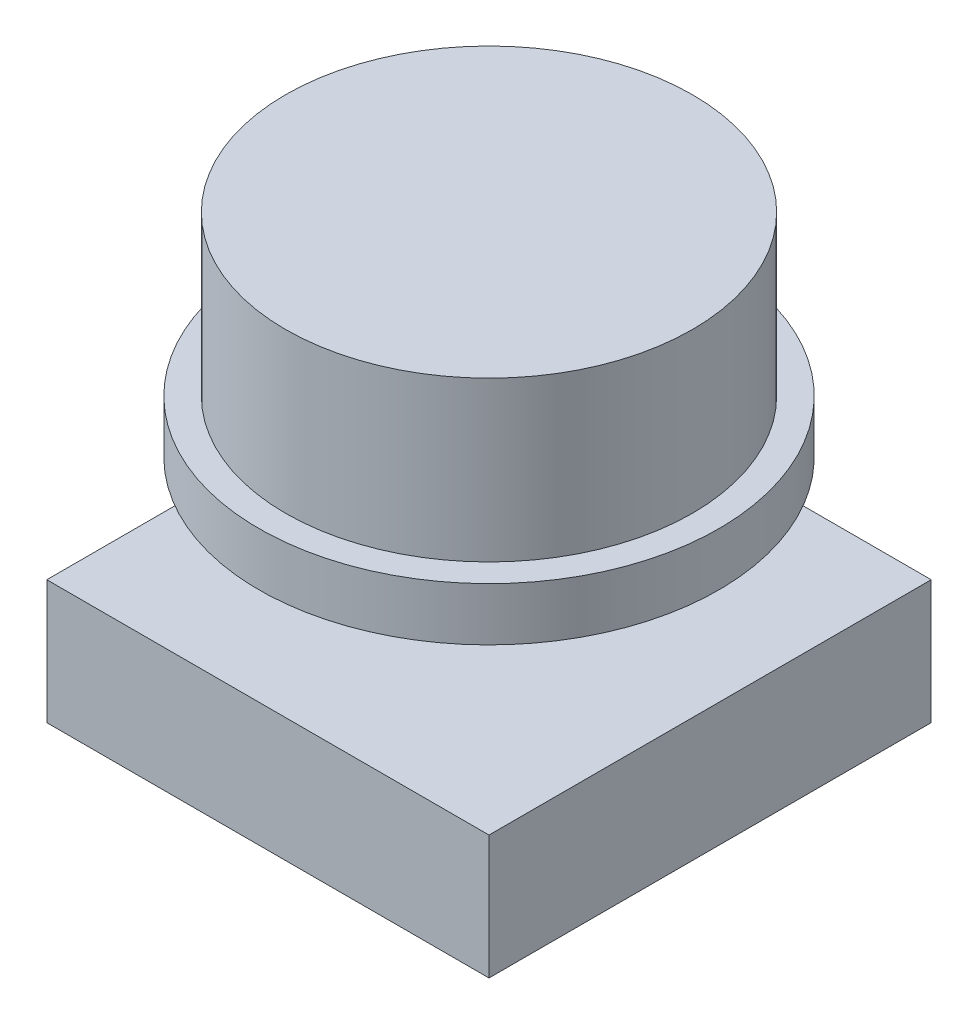
ISO-10303-21;
HEADER;
FILE_DESCRIPTION(('STEP AP214'),'2;1');
FILE_NAME('part.step','',(''),(''),'','','');
FILE_SCHEMA(('AUTOMOTIVE_DESIGN { 1 0 10303 214 1 1 1 1 }'));
ENDSEC;
DATA;
#1=APPLICATION_CONTEXT('core data for automotive mechanical design processes');
#2=APPLICATION_PROTOCOL_DEFINITION('international standard','automotive_design',2000,#1);
#3=PRODUCT_CONTEXT('',#1,'mechanical');
#4=PRODUCT('Part','Part','',(#3));
#5=PRODUCT_RELATED_PRODUCT_CATEGORY('part','',(#4));
#6=PRODUCT_DEFINITION_FORMATION('','',#4);
#7=PRODUCT_DEFINITION_CONTEXT('part definition',#1,'design');
#8=PRODUCT_DEFINITION('design','',#6,#7);
#9=PRODUCT_DEFINITION_SHAPE('','',#8);
#10=(LENGTH_UNIT() NAMED_UNIT(*) SI_UNIT(.MILLI.,.METRE.));
#11=(NAMED_UNIT(*) PLANE_ANGLE_UNIT() SI_UNIT($,.RADIAN.));
#12=(NAMED_UNIT(*) SI_UNIT($,.STERADIAN.) SOLID_ANGLE_UNIT());
#13=UNCERTAINTY_MEASURE_WITH_UNIT(LENGTH_MEASURE(1.E-05),#10,'distance_accuracy_value','');
#14=(GEOMETRIC_REPRESENTATION_CONTEXT(3) GLOBAL_UNCERTAINTY_ASSIGNED_CONTEXT((#13)) GLOBAL_UNIT_ASSIGNED_CONTEXT((#10,
#11,#12)) REPRESENTATION_CONTEXT('',''));
#15=CARTESIAN_POINT('',(0.,0.,0.));
#16=DIRECTION('',(0.,0.,1.));
#17=DIRECTION('',(1.,0.,0.));
#18=AXIS2_PLACEMENT_3D('',#15,#16,#17);
#19=CARTESIAN_POINT('',(0.,6.,0.));
#20=DIRECTION('',(0.,-1.,0.));
#21=DIRECTION('',(0.,0.,-1.));
#22=AXIS2_PLACEMENT_3D('',#19,#20,#21);
#23=CYLINDRICAL_SURFACE('',#22,5.75);
#24=CARTESIAN_POINT('',(0.,6.,0.));
#25=DIRECTION('',(0.,1.,0.));
#26=DIRECTION('',(0.,0.,1.));
#27=AXIS2_PLACEMENT_3D('',#24,#25,#26);
#28=CIRCLE('',#27,5.75);
#29=CARTESIAN_POINT('',(0.,6.,5.75));
#30=VERTEX_POINT('',#29);
#31=EDGE_CURVE('E190',#30,#30,#28,.T.);
#32=ORIENTED_EDGE('',*,*,#31,.F.);
#33=EDGE_LOOP('',(#32));
#34=FACE_BOUND('',#33,.T.);
#35=CARTESIAN_POINT('',(0.,1.5,0.));
#36=DIRECTION('',(0.,-1.,0.));
#37=DIRECTION('',(0.,0.,-1.));
#38=AXIS2_PLACEMENT_3D('',#35,#36,#37);
#39=CIRCLE('',#38,5.75);
#40=CARTESIAN_POINT('',(0.,1.5,-5.75));
#41=VERTEX_POINT('',#40);
#42=EDGE_CURVE('E197',#41,#41,#39,.T.);
#43=ORIENTED_EDGE('',*,*,#42,.F.);
#44=EDGE_LOOP('',(#43));
#45=FACE_BOUND('',#44,.T.);
#46=ADVANCED_FACE('F45',(#34,#45),#23,.T.);
#47=CARTESIAN_POINT('',(0.,6.,0.));
#48=DIRECTION('',(0.,1.,0.));
#49=DIRECTION('',(0.,0.,1.));
#50=AXIS2_PLACEMENT_3D('',#47,#48,#49);
#51=PLANE('',#50);
#52=ORIENTED_EDGE('',*,*,#31,.T.);
#53=EDGE_LOOP('',(#52));
#54=FACE_BOUND('',#53,.T.);
#55=ADVANCED_FACE('F238',(#54),#51,.T.);
#56=CARTESIAN_POINT('',(0.,1.5,0.));
#57=DIRECTION('',(0.,-1.,0.));
#58=DIRECTION('',(0.,0.,-1.));
#59=AXIS2_PLACEMENT_3D('',#56,#57,#58);
#60=CYLINDRICAL_SURFACE('',#59,6.5);
#61=CARTESIAN_POINT('',(0.,1.5,0.));
#62=DIRECTION('',(0.,-1.,0.));
#63=DIRECTION('',(0.,0.,-1.));
#64=AXIS2_PLACEMENT_3D('',#61,#62,#63);
#65=CIRCLE('',#64,6.5);
#66=CARTESIAN_POINT('',(0.,1.5,-6.5));
#67=VERTEX_POINT('',#66);
#68=EDGE_CURVE('E186',#67,#67,#65,.T.);
#69=ORIENTED_EDGE('',*,*,#68,.T.);
#70=EDGE_LOOP('',(#69));
#71=FACE_BOUND('',#70,.T.);
#72=CARTESIAN_POINT('',(0.,0.,0.));
#73=DIRECTION('',(0.,-1.,0.));
#74=DIRECTION('',(0.,0.,-1.));
#75=AXIS2_PLACEMENT_3D('',#72,#73,#74);
#76=CIRCLE('',#75,6.5);
#77=CARTESIAN_POINT('',(0.,0.,-6.5));
#78=VERTEX_POINT('',#77);
#79=EDGE_CURVE('E177',#78,#78,#76,.T.);
#80=ORIENTED_EDGE('',*,*,#79,.F.);
#81=EDGE_LOOP('',(#80));
#82=FACE_BOUND('',#81,.T.);
#83=ADVANCED_FACE('F243',(#71,#82),#60,.T.);
#84=CARTESIAN_POINT('',(0.,1.5,0.));
#85=DIRECTION('',(0.,-1.,0.));
#86=DIRECTION('',(0.,0.,-1.));
#87=AXIS2_PLACEMENT_3D('',#84,#85,#86);
#88=PLANE('',#87);
#89=ORIENTED_EDGE('',*,*,#42,.T.);
#90=EDGE_LOOP('',(#89));
#91=FACE_BOUND('',#90,.T.);
#92=ORIENTED_EDGE('',*,*,#68,.F.);
#93=EDGE_LOOP('',(#92));
#94=FACE_BOUND('',#93,.T.);
#95=ADVANCED_FACE('F250',(#91,#94),#88,.F.);
#96=CARTESIAN_POINT('',(0.,0.,0.));
#97=DIRECTION('',(0.,1.,0.));
#98=DIRECTION('',(0.,0.,1.));
#99=AXIS2_PLACEMENT_3D('',#96,#97,#98);
#100=PLANE('',#99);
#101=DIRECTION('',(-1.,0.,0.));
#102=VECTOR('',#101,1.);
#103=CARTESIAN_POINT('',(0.,0.,-1.5));
#104=LINE('',#103,#102);
#105=CARTESIAN_POINT('',(1.5,0.,-1.5));
#106=VERTEX_POINT('',#105);
#107=CARTESIAN_POINT('',(-1.5,0.,-1.5));
#108=VERTEX_POINT('',#107);
#109=EDGE_CURVE('E209',#106,#108,#104,.T.);
#110=ORIENTED_EDGE('',*,*,#109,.T.);
#111=DIRECTION('',(0.,0.,1.));
#112=VECTOR('',#111,1.);
#113=CARTESIAN_POINT('',(-1.5,0.,0.));
#114=LINE('',#113,#112);
#115=CARTESIAN_POINT('',(-1.5,0.,1.5));
#116=VERTEX_POINT('',#115);
#117=EDGE_CURVE('E53',#108,#116,#114,.T.);
#118=ORIENTED_EDGE('',*,*,#117,.T.);
#119=DIRECTION('',(1.,0.,0.));
#120=VECTOR('',#119,1.);
#121=CARTESIAN_POINT('',(0.,0.,1.5));
#122=LINE('',#121,#120);
#123=CARTESIAN_POINT('',(1.5,0.,1.5));
#124=VERTEX_POINT('',#123);
#125=EDGE_CURVE('E201',#116,#124,#122,.T.);
#126=ORIENTED_EDGE('',*,*,#125,.T.);
#127=DIRECTION('',(0.,0.,-1.));
#128=VECTOR('',#127,1.);
#129=CARTESIAN_POINT('',(1.5,0.,0.));
#130=LINE('',#129,#128);
#131=EDGE_CURVE('E205',#124,#106,#130,.T.);
#132=ORIENTED_EDGE('',*,*,#131,.T.);
#133=EDGE_LOOP('',(#110,#118,#126,#132));
#134=FACE_BOUND('',#133,.T.);
#135=ORIENTED_EDGE('',*,*,#79,.T.);
#136=EDGE_LOOP('',(#135));
#137=FACE_BOUND('',#136,.T.);
#138=ADVANCED_FACE('F216',(#134,#137),#100,.F.);
#139=CARTESIAN_POINT('',(-1.5,-6.5,0.));
#140=DIRECTION('',(-1.,0.,0.));
#141=DIRECTION('',(0.,0.,1.));
#142=AXIS2_PLACEMENT_3D('',#139,#140,#141);
#143=PLANE('',#142);
#144=DIRECTION('',(0.,0.,-1.));
#145=VECTOR('',#144,1.);
#146=CARTESIAN_POINT('',(-1.5,-3.,0.));
#147=LINE('',#146,#145);
#148=CARTESIAN_POINT('',(-1.5,-3.,1.5));
#149=VERTEX_POINT('',#148);
#150=CARTESIAN_POINT('',(-1.5,-3.,-1.5));
#151=VERTEX_POINT('',#150);
#152=EDGE_CURVE('E169',#149,#151,#147,.T.);
#153=ORIENTED_EDGE('',*,*,#152,.F.);
#154=DIRECTION('',(0.,1.,0.));
#155=VECTOR('',#154,1.);
#156=CARTESIAN_POINT('',(-1.5,-6.5,1.5));
#157=LINE('',#156,#155);
#158=EDGE_CURVE('E173',#149,#116,#157,.T.);
#159=ORIENTED_EDGE('',*,*,#158,.T.);
#160=ORIENTED_EDGE('',*,*,#117,.F.);
#161=DIRECTION('',(0.,1.,0.));
#162=VECTOR('',#161,1.);
#163=CARTESIAN_POINT('',(-1.5,-6.5,-1.5));
#164=LINE('',#163,#162);
#165=EDGE_CURVE('E174',#151,#108,#164,.T.);
#166=ORIENTED_EDGE('',*,*,#165,.F.);
#167=EDGE_LOOP('',(#153,#159,#160,#166));
#168=FACE_BOUND('',#167,.T.);
#169=ADVANCED_FACE('F222',(#168),#143,.T.);
#170=CARTESIAN_POINT('',(0.,-6.5,-1.5));
#171=DIRECTION('',(0.,0.,-1.));
#172=DIRECTION('',(-1.,0.,0.));
#173=AXIS2_PLACEMENT_3D('',#170,#171,#172);
#174=PLANE('',#173);
#175=DIRECTION('',(1.,0.,0.));
#176=VECTOR('',#175,1.);
#177=CARTESIAN_POINT('',(0.,-3.,-1.5));
#178=LINE('',#177,#176);
#179=CARTESIAN_POINT('',(1.5,-3.,-1.5));
#180=VERTEX_POINT('',#179);
#181=EDGE_CURVE('E60',#151,#180,#178,.T.);
#182=ORIENTED_EDGE('',*,*,#181,.F.);
#183=ORIENTED_EDGE('',*,*,#165,.T.);
#184=ORIENTED_EDGE('',*,*,#109,.F.);
#185=DIRECTION('',(0.,1.,0.));
#186=VECTOR('',#185,1.);
#187=CARTESIAN_POINT('',(1.5,-6.5,-1.5));
#188=LINE('',#187,#186);
#189=EDGE_CURVE('E178',#180,#106,#188,.T.);
#190=ORIENTED_EDGE('',*,*,#189,.F.);
#191=EDGE_LOOP('',(#182,#183,#184,#190));
#192=FACE_BOUND('',#191,.T.);
#193=ADVANCED_FACE('F227',(#192),#174,.T.);
#194=CARTESIAN_POINT('',(1.5,-6.5,0.));
#195=DIRECTION('',(1.,0.,0.));
#196=DIRECTION('',(0.,0.,-1.));
#197=AXIS2_PLACEMENT_3D('',#194,#195,#196);
#198=PLANE('',#197);
#199=DIRECTION('',(0.,0.,1.));
#200=VECTOR('',#199,1.);
#201=CARTESIAN_POINT('',(1.5,-3.,0.));
#202=LINE('',#201,#200);
#203=CARTESIAN_POINT('',(1.5,-3.,1.5));
#204=VERTEX_POINT('',#203);
#205=EDGE_CURVE('E68',#180,#204,#202,.T.);
#206=ORIENTED_EDGE('',*,*,#205,.F.);
#207=ORIENTED_EDGE('',*,*,#189,.T.);
#208=ORIENTED_EDGE('',*,*,#131,.F.);
#209=DIRECTION('',(0.,1.,0.));
#210=VECTOR('',#209,1.);
#211=CARTESIAN_POINT('',(1.5,-6.5,1.5));
#212=LINE('',#211,#210);
#213=EDGE_CURVE('E181',#204,#124,#212,.T.);
#214=ORIENTED_EDGE('',*,*,#213,.F.);
#215=EDGE_LOOP('',(#206,#207,#208,#214));
#216=FACE_BOUND('',#215,.T.);
#217=ADVANCED_FACE('F226',(#216),#198,.T.);
#218=CARTESIAN_POINT('',(0.,-6.5,1.5));
#219=DIRECTION('',(0.,0.,1.));
#220=DIRECTION('',(1.,0.,0.));
#221=AXIS2_PLACEMENT_3D('',#218,#219,#220);
#222=PLANE('',#221);
#223=DIRECTION('',(-1.,0.,0.));
#224=VECTOR('',#223,1.);
#225=CARTESIAN_POINT('',(0.,-3.,1.5));
#226=LINE('',#225,#224);
#227=EDGE_CURVE('E11',#204,#149,#226,.T.);
#228=ORIENTED_EDGE('',*,*,#227,.F.);
#229=ORIENTED_EDGE('',*,*,#213,.T.);
#230=ORIENTED_EDGE('',*,*,#125,.F.);
#231=ORIENTED_EDGE('',*,*,#158,.F.);
#232=EDGE_LOOP('',(#228,#229,#230,#231));
#233=FACE_BOUND('',#232,.T.);
#234=ADVANCED_FACE('F224',(#233),#222,.T.);
#235=CARTESIAN_POINT('',(6.25,-3.,-6.25));
#236=DIRECTION('',(1.,0.,0.));
#237=DIRECTION('',(0.,0.,-1.));
#238=AXIS2_PLACEMENT_3D('',#235,#236,#237);
#239=PLANE('',#238);
#240=DIRECTION('',(0.,0.,1.));
#241=VECTOR('',#240,1.);
#242=CARTESIAN_POINT('',(6.25,-6.5,-6.25));
#243=LINE('',#242,#241);
#244=CARTESIAN_POINT('',(6.25,-6.5,-6.25));
#245=VERTEX_POINT('',#244);
#246=CARTESIAN_POINT('',(6.25,-6.5,6.25));
#247=VERTEX_POINT('',#246);
#248=EDGE_CURVE('E150',#245,#247,#243,.T.);
#249=ORIENTED_EDGE('',*,*,#248,.F.);
#250=DIRECTION('',(0.,-1.,0.));
#251=VECTOR('',#250,1.);
#252=CARTESIAN_POINT('',(6.25,-3.,-6.25));
#253=LINE('',#252,#251);
#254=CARTESIAN_POINT('',(6.25,-3.,-6.25));
#255=VERTEX_POINT('',#254);
#256=EDGE_CURVE('E137',#255,#245,#253,.T.);
#257=ORIENTED_EDGE('',*,*,#256,.F.);
#258=DIRECTION('',(0.,0.,1.));
#259=VECTOR('',#258,1.);
#260=CARTESIAN_POINT('',(6.25,-3.,-6.25));
#261=LINE('',#260,#259);
#262=CARTESIAN_POINT('',(6.25,-3.,6.25));
#263=VERTEX_POINT('',#262);
#264=EDGE_CURVE('E130',#255,#263,#261,.T.);
#265=ORIENTED_EDGE('',*,*,#264,.T.);
#266=DIRECTION('',(0.,-1.,0.));
#267=VECTOR('',#266,1.);
#268=CARTESIAN_POINT('',(6.25,-3.,6.25));
#269=LINE('',#268,#267);
#270=EDGE_CURVE('E111',#263,#247,#269,.T.);
#271=ORIENTED_EDGE('',*,*,#270,.T.);
#272=EDGE_LOOP('',(#249,#257,#265,#271));
#273=FACE_BOUND('',#272,.T.);
#274=ADVANCED_FACE('F136',(#273),#239,.T.);
#275=CARTESIAN_POINT('',(-6.25,-3.,-6.25));
#276=DIRECTION('',(0.,0.,-1.));
#277=DIRECTION('',(-1.,0.,0.));
#278=AXIS2_PLACEMENT_3D('',#275,#276,#277);
#279=PLANE('',#278);
#280=DIRECTION('',(1.,0.,0.));
#281=VECTOR('',#280,1.);
#282=CARTESIAN_POINT('',(-6.25,-6.5,-6.25));
#283=LINE('',#282,#281);
#284=CARTESIAN_POINT('',(-6.25,-6.5,-6.25));
#285=VERTEX_POINT('',#284);
#286=EDGE_CURVE('E139',#285,#245,#283,.T.);
#287=ORIENTED_EDGE('',*,*,#286,.F.);
#288=DIRECTION('',(0.,-1.,0.));
#289=VECTOR('',#288,1.);
#290=CARTESIAN_POINT('',(-6.25,-3.,-6.25));
#291=LINE('',#290,#289);
#292=CARTESIAN_POINT('',(-6.25,-3.,-6.25));
#293=VERTEX_POINT('',#292);
#294=EDGE_CURVE('E160',#293,#285,#291,.T.);
#295=ORIENTED_EDGE('',*,*,#294,.F.);
#296=DIRECTION('',(1.,0.,0.));
#297=VECTOR('',#296,1.);
#298=CARTESIAN_POINT('',(-6.25,-3.,-6.25));
#299=LINE('',#298,#297);
#300=EDGE_CURVE('E123',#293,#255,#299,.T.);
#301=ORIENTED_EDGE('',*,*,#300,.T.);
#302=ORIENTED_EDGE('',*,*,#256,.T.);
#303=EDGE_LOOP('',(#287,#295,#301,#302));
#304=FACE_BOUND('',#303,.T.);
#305=ADVANCED_FACE('F268',(#304),#279,.T.);
#306=CARTESIAN_POINT('',(-6.25,-3.,-6.25));
#307=DIRECTION('',(-1.,0.,0.));
#308=DIRECTION('',(0.,0.,1.));
#309=AXIS2_PLACEMENT_3D('',#306,#307,#308);
#310=PLANE('',#309);
#311=DIRECTION('',(0.,0.,-1.));
#312=VECTOR('',#311,1.);
#313=CARTESIAN_POINT('',(-6.25,-6.5,-6.25));
#314=LINE('',#313,#312);
#315=CARTESIAN_POINT('',(-6.25,-6.5,6.25));
#316=VERTEX_POINT('',#315);
#317=EDGE_CURVE('E143',#316,#285,#314,.T.);
#318=ORIENTED_EDGE('',*,*,#317,.F.);
#319=DIRECTION('',(0.,-1.,0.));
#320=VECTOR('',#319,1.);
#321=CARTESIAN_POINT('',(-6.25,-3.,6.25));
#322=LINE('',#321,#320);
#323=CARTESIAN_POINT('',(-6.25,-3.,6.25));
#324=VERTEX_POINT('',#323);
#325=EDGE_CURVE('E122',#324,#316,#322,.T.);
#326=ORIENTED_EDGE('',*,*,#325,.F.);
#327=DIRECTION('',(0.,0.,-1.));
#328=VECTOR('',#327,1.);
#329=CARTESIAN_POINT('',(-6.25,-3.,-6.25));
#330=LINE('',#329,#328);
#331=EDGE_CURVE('E133',#324,#293,#330,.T.);
#332=ORIENTED_EDGE('',*,*,#331,.T.);
#333=ORIENTED_EDGE('',*,*,#294,.T.);
#334=EDGE_LOOP('',(#318,#326,#332,#333));
#335=FACE_BOUND('',#334,.T.);
#336=ADVANCED_FACE('F273',(#335),#310,.T.);
#337=CARTESIAN_POINT('',(-6.25,-3.,6.25));
#338=DIRECTION('',(0.,0.,1.));
#339=DIRECTION('',(1.,0.,0.));
#340=AXIS2_PLACEMENT_3D('',#337,#338,#339);
#341=PLANE('',#340);
#342=DIRECTION('',(-1.,0.,0.));
#343=VECTOR('',#342,1.);
#344=CARTESIAN_POINT('',(-6.25,-6.5,6.25));
#345=LINE('',#344,#343);
#346=EDGE_CURVE('E116',#247,#316,#345,.T.);
#347=ORIENTED_EDGE('',*,*,#346,.F.);
#348=ORIENTED_EDGE('',*,*,#270,.F.);
#349=DIRECTION('',(-1.,0.,0.));
#350=VECTOR('',#349,1.);
#351=CARTESIAN_POINT('',(-6.25,-3.,6.25));
#352=LINE('',#351,#350);
#353=EDGE_CURVE('E114',#263,#324,#352,.T.);
#354=ORIENTED_EDGE('',*,*,#353,.T.);
#355=ORIENTED_EDGE('',*,*,#325,.T.);
#356=EDGE_LOOP('',(#347,#348,#354,#355));
#357=FACE_BOUND('',#356,.T.);
#358=ADVANCED_FACE('F113',(#357),#341,.T.);
#359=CARTESIAN_POINT('',(0.,-3.,0.));
#360=DIRECTION('',(0.,1.,0.));
#361=DIRECTION('',(0.,0.,1.));
#362=AXIS2_PLACEMENT_3D('',#359,#360,#361);
#363=PLANE('',#362);
#364=ORIENTED_EDGE('',*,*,#227,.T.);
#365=ORIENTED_EDGE('',*,*,#152,.T.);
#366=ORIENTED_EDGE('',*,*,#181,.T.);
#367=ORIENTED_EDGE('',*,*,#205,.T.);
#368=EDGE_LOOP('',(#364,#365,#366,#367));
#369=FACE_BOUND('',#368,.T.);
#370=ORIENTED_EDGE('',*,*,#264,.F.);
#371=ORIENTED_EDGE('',*,*,#300,.F.);
#372=ORIENTED_EDGE('',*,*,#331,.F.);
#373=ORIENTED_EDGE('',*,*,#353,.F.);
#374=EDGE_LOOP('',(#370,#371,#372,#373));
#375=FACE_BOUND('',#374,.T.);
#376=ADVANCED_FACE('F128',(#369,#375),#363,.T.);
#377=CARTESIAN_POINT('',(0.,-6.5,0.));
#378=DIRECTION('',(0.,1.,0.));
#379=DIRECTION('',(0.,0.,1.));
#380=AXIS2_PLACEMENT_3D('',#377,#378,#379);
#381=PLANE('',#380);
#382=ORIENTED_EDGE('',*,*,#248,.T.);
#383=ORIENTED_EDGE('',*,*,#346,.T.);
#384=ORIENTED_EDGE('',*,*,#317,.T.);
#385=ORIENTED_EDGE('',*,*,#286,.T.);
#386=EDGE_LOOP('',(#382,#383,#384,#385));
#387=FACE_BOUND('',#386,.T.);
#388=ADVANCED_FACE('F278',(#387),#381,.F.);
#389=CLOSED_SHELL('',(#46,#55,#83,#95,#138,#169,#193,#217,#234,#274,#305,#336,#358,#376,#388));
#390=MANIFOLD_SOLID_BREP('B2',#389);
#391=ADVANCED_BREP_SHAPE_REPRESENTATION('',(#18,#390),#14);
#392=SHAPE_DEFINITION_REPRESENTATION(#9,#391);
ENDSEC;
END-ISO-10303-21;
